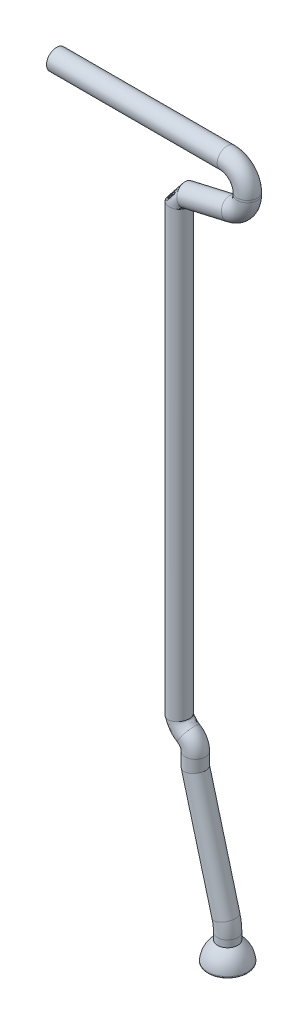
ISO-10303-21;
HEADER;
FILE_DESCRIPTION(('STEP AP214'),'2;1');
FILE_NAME('part.step','',(''),(''),'','','');
FILE_SCHEMA(('AUTOMOTIVE_DESIGN { 1 0 10303 214 1 1 1 1 }'));
ENDSEC;
DATA;
#1=APPLICATION_CONTEXT('core data for automotive mechanical design processes');
#2=APPLICATION_PROTOCOL_DEFINITION('international standard','automotive_design',2000,#1);
#3=PRODUCT_CONTEXT('',#1,'mechanical');
#4=PRODUCT('Part','Part','',(#3));
#5=PRODUCT_RELATED_PRODUCT_CATEGORY('part','',(#4));
#6=PRODUCT_DEFINITION_FORMATION('','',#4);
#7=PRODUCT_DEFINITION_CONTEXT('part definition',#1,'design');
#8=PRODUCT_DEFINITION('design','',#6,#7);
#9=PRODUCT_DEFINITION_SHAPE('','',#8);
#10=(LENGTH_UNIT() NAMED_UNIT(*) SI_UNIT(.MILLI.,.METRE.));
#11=(NAMED_UNIT(*) PLANE_ANGLE_UNIT() SI_UNIT($,.RADIAN.));
#12=(NAMED_UNIT(*) SI_UNIT($,.STERADIAN.) SOLID_ANGLE_UNIT());
#13=UNCERTAINTY_MEASURE_WITH_UNIT(LENGTH_MEASURE(1.E-05),#10,'distance_accuracy_value','');
#14=(GEOMETRIC_REPRESENTATION_CONTEXT(3) GLOBAL_UNCERTAINTY_ASSIGNED_CONTEXT((#13)) GLOBAL_UNIT_ASSIGNED_CONTEXT((#10,
#11,#12)) REPRESENTATION_CONTEXT('',''));
#15=CARTESIAN_POINT('',(0.,0.,0.));
#16=DIRECTION('',(0.,0.,1.));
#17=DIRECTION('',(1.,0.,0.));
#18=AXIS2_PLACEMENT_3D('',#15,#16,#17);
#19=CARTESIAN_POINT('',(14.5384757729335,-40.5165249758739,0.));
#20=DIRECTION('',(0.,-1.,0.));
#21=DIRECTION('',(0.,0.,-1.));
#22=AXIS2_PLACEMENT_3D('',#19,#20,#21);
#23=CYLINDRICAL_SURFACE('',#22,2.49999999999999);
#24=CARTESIAN_POINT('',(14.5384757729335,-40.5165249758739,0.));
#25=DIRECTION('',(0.,-1.,0.));
#26=DIRECTION('',(1.,0.,0.));
#27=AXIS2_PLACEMENT_3D('',#24,#25,#26);
#28=CIRCLE('',#27,2.49999999999999);
#29=CARTESIAN_POINT('',(17.0384757729335,-40.5165249758739,0.));
#30=VERTEX_POINT('',#29);
#31=EDGE_CURVE('E48',#30,#30,#28,.T.);
#32=ORIENTED_EDGE('',*,*,#31,.T.);
#33=EDGE_LOOP('',(#32));
#34=FACE_BOUND('',#33,.T.);
#35=CARTESIAN_POINT('',(14.5384757729335,-42.2,0.));
#36=DIRECTION('',(0.,-1.,0.));
#37=DIRECTION('',(1.,0.,0.));
#38=AXIS2_PLACEMENT_3D('',#35,#36,#37);
#39=CIRCLE('',#38,2.49999999999999);
#40=CARTESIAN_POINT('',(17.0384757729335,-42.2,0.));
#41=VERTEX_POINT('',#40);
#42=EDGE_CURVE('E13',#41,#41,#39,.T.);
#43=ORIENTED_EDGE('',*,*,#42,.F.);
#44=EDGE_LOOP('',(#43));
#45=FACE_BOUND('',#44,.T.);
#46=ADVANCED_FACE('F42',(#34,#45),#23,.T.);
#47=CARTESIAN_POINT('',(2.03847577293351,-40.5165249758739,0.));
#48=DIRECTION('',(0.,0.,-1.));
#49=DIRECTION('',(-1.,0.,0.));
#50=AXIS2_PLACEMENT_3D('',#47,#48,#49);
#51=TOROIDAL_SURFACE('',#50,12.5,2.49999999999999);
#52=CARTESIAN_POINT('',(14.1125486015469,-37.2812869120925,0.));
#53=DIRECTION('',(0.258819045102514,-0.96592582628907,0.));
#54=DIRECTION('',(0.96592582628907,0.258819045102514,0.));
#55=AXIS2_PLACEMENT_3D('',#52,#53,#54);
#56=CIRCLE('',#55,2.49999999999999);
#57=CARTESIAN_POINT('',(16.5273631672695,-36.6342392993362,0.));
#58=VERTEX_POINT('',#57);
#59=EDGE_CURVE('E75',#58,#58,#56,.T.);
#60=CARTESIAN_POINT('',(2.03847577293351,-40.5165249758739,0.));
#61=DIRECTION('',(0.,0.,-1.));
#62=DIRECTION('',(-1.,0.,0.));
#63=AXIS2_PLACEMENT_3D('',#60,#61,#62);
#64=CIRCLE('',#63,15.);
#65=EDGE_CURVE('',#58,#30,#64,.T.);
#66=ORIENTED_EDGE('',*,*,#59,.T.);
#67=ORIENTED_EDGE('',*,*,#31,.F.);
#68=ORIENTED_EDGE('',*,*,#65,.T.);
#69=ORIENTED_EDGE('',*,*,#65,.F.);
#70=EDGE_LOOP('',(#66,#68,#67,#69));
#71=FACE_BOUND('',#70,.T.);
#72=ADVANCED_FACE('F82',(#71),#51,.T.);
#73=CARTESIAN_POINT('',(6.50000000000001,-8.87086875603153,0.));
#74=DIRECTION('',(0.258819045102515,-0.96592582628907,0.));
#75=DIRECTION('',(0.96592582628907,0.258819045102515,0.));
#76=AXIS2_PLACEMENT_3D('',#73,#74,#75);
#77=CYLINDRICAL_SURFACE('',#76,2.49999999999999);
#78=CARTESIAN_POINT('',(6.50000000000001,-8.87086875603153,0.));
#79=DIRECTION('',(0.130526192220048,-0.991444861373811,0.));
#80=DIRECTION('',(-0.991444861373811,-0.130526192220048,0.));
#81=AXIS2_PLACEMENT_3D('',#78,#79,#80);
#82=ELLIPSE('',#81,2.52157240145037,2.49999999999999);
#83=CARTESIAN_POINT('',(4.00000000000002,-9.20000000000001,0.));
#84=VERTEX_POINT('',#83);
#85=EDGE_CURVE('E72',#84,#84,#82,.F.);
#86=ORIENTED_EDGE('',*,*,#85,.F.);
#87=EDGE_LOOP('',(#86));
#88=FACE_BOUND('',#87,.T.);
#89=ORIENTED_EDGE('',*,*,#59,.F.);
#90=EDGE_LOOP('',(#89));
#91=FACE_BOUND('',#90,.T.);
#92=ADVANCED_FACE('F84',(#88,#91),#77,.T.);
#93=CARTESIAN_POINT('',(6.50000000000001,-5.58007283046414,0.));
#94=DIRECTION('',(0.,-1.,0.));
#95=DIRECTION('',(0.,0.,-1.));
#96=AXIS2_PLACEMENT_3D('',#93,#94,#95);
#97=CYLINDRICAL_SURFACE('',#96,2.49999999999999);
#98=CARTESIAN_POINT('',(6.50000000000001,-5.58007283046414,0.));
#99=DIRECTION('',(0.,-1.,0.));
#100=DIRECTION('',(1.,0.,0.));
#101=AXIS2_PLACEMENT_3D('',#98,#99,#100);
#102=CIRCLE('',#101,2.49999999999999);
#103=CARTESIAN_POINT('',(9.,-5.58007283046413,0.));
#104=VERTEX_POINT('',#103);
#105=EDGE_CURVE('E58',#104,#104,#102,.T.);
#106=ORIENTED_EDGE('',*,*,#105,.T.);
#107=EDGE_LOOP('',(#106));
#108=FACE_BOUND('',#107,.T.);
#109=ORIENTED_EDGE('',*,*,#85,.T.);
#110=EDGE_LOOP('',(#109));
#111=FACE_BOUND('',#110,.T.);
#112=ADVANCED_FACE('F90',(#108,#111),#97,.T.);
#113=CARTESIAN_POINT('',(3.00000000000003,-5.58007283046414,0.));
#114=DIRECTION('',(0.,0.,-1.));
#115=DIRECTION('',(-1.,0.,0.));
#116=AXIS2_PLACEMENT_3D('',#113,#114,#115);
#117=TOROIDAL_SURFACE('',#116,3.49999999999998,2.49999999999999);
#118=CARTESIAN_POINT('',(4.83745806223148,-2.60118916883173,0.));
#119=DIRECTION('',(0.851109617609264,-0.524988017780419,0.));
#120=DIRECTION('',(0.524988017780419,0.851109617609264,0.));
#121=AXIS2_PLACEMENT_3D('',#118,#119,#120);
#122=CIRCLE('',#121,2.49999999999999);
#123=CARTESIAN_POINT('',(6.14992810668252,-0.473415124808582,0.));
#124=VERTEX_POINT('',#123);
#125=EDGE_CURVE('E166',#124,#124,#122,.T.);
#126=CARTESIAN_POINT('',(3.00000000000003,-5.58007283046414,0.));
#127=DIRECTION('',(0.,0.,-1.));
#128=DIRECTION('',(-1.,0.,0.));
#129=AXIS2_PLACEMENT_3D('',#126,#127,#128);
#130=CIRCLE('',#129,5.99999999999997);
#131=EDGE_CURVE('',#124,#104,#130,.T.);
#132=ORIENTED_EDGE('',*,*,#125,.T.);
#133=ORIENTED_EDGE('',*,*,#105,.F.);
#134=ORIENTED_EDGE('',*,*,#131,.T.);
#135=ORIENTED_EDGE('',*,*,#131,.F.);
#136=EDGE_LOOP('',(#132,#134,#133,#135));
#137=FACE_BOUND('',#136,.T.);
#138=ADVANCED_FACE('F96',(#137),#117,.T.);
#139=CARTESIAN_POINT('',(2.49999999999997,111.017615984978,0.));
#140=DIRECTION('',(0.,-1.,0.));
#141=DIRECTION('',(0.,0.,-1.));
#142=AXIS2_PLACEMENT_3D('',#139,#140,#141);
#143=CYLINDRICAL_SURFACE('',#142,2.49999999999999);
#144=CARTESIAN_POINT('',(2.49999999999997,111.017615984978,0.));
#145=DIRECTION('',(0.,-1.,0.));
#146=DIRECTION('',(0.,0.,-1.));
#147=AXIS2_PLACEMENT_3D('',#144,#145,#146);
#148=CIRCLE('',#147,2.49999999999999);
#149=CARTESIAN_POINT('',(4.99999999999998,111.017615984978,0.));
#150=VERTEX_POINT('',#149);
#151=EDGE_CURVE('E52',#150,#150,#148,.T.);
#152=ORIENTED_EDGE('',*,*,#151,.T.);
#153=EDGE_LOOP('',(#152));
#154=FACE_BOUND('',#153,.T.);
#155=CARTESIAN_POINT('',(4.99999999999997,0.661344353542473,0.));
#156=CARTESIAN_POINT('',(4.99999999999996,0.661344353542473,-4.99999999999998));
#157=CARTESIAN_POINT('',(0.,0.,-4.99999999999998));
#158=CARTESIAN_POINT('',(0.,0.,0.));
#159=CARTESIAN_POINT('',(0.,0.,4.99999999999998));
#160=CARTESIAN_POINT('',(4.99999999999997,0.661344353542473,4.99999999999998));
#161=CARTESIAN_POINT('',(4.99999999999997,0.661344353542473,0.));
#162=(BOUNDED_CURVE() B_SPLINE_CURVE(3,(#155,#156,#157,#158,#159,#160,#161),.UNSPECIFIED.,.T.,
.F.) B_SPLINE_CURVE_WITH_KNOTS((4,3,4),(0.,0.5,1.),
.UNSPECIFIED.) CURVE() GEOMETRIC_REPRESENTATION_ITEM() RATIONAL_B_SPLINE_CURVE((1.,
0.333333333333333,0.333333333333333,1.,0.333333333333333,0.333333333333333,1.)) REPRESENTATION_ITEM(''));
#163=CARTESIAN_POINT('',(4.99999999999997,0.661344353542473,0.));
#164=VERTEX_POINT('',#163);
#165=EDGE_CURVE('E159',#164,#164,#162,.T.);
#166=ORIENTED_EDGE('',*,*,#165,.T.);
#167=EDGE_LOOP('',(#166));
#168=FACE_BOUND('',#167,.T.);
#169=ADVANCED_FACE('F54',(#154,#168),#143,.T.);
#170=CARTESIAN_POINT('',(5.,111.017615984978,0.));
#171=DIRECTION('',(0.,0.,1.));
#172=DIRECTION('',(1.,0.,0.));
#173=AXIS2_PLACEMENT_3D('',#170,#171,#172);
#174=TOROIDAL_SURFACE('',#173,2.50000000000003,2.49999999999999);
#175=CARTESIAN_POINT('',(4.44072713472685,113.454255856229,0.));
#176=DIRECTION('',(-0.974655948500326,-0.223709146109252,0.));
#177=DIRECTION('',(0.,0.,-1.));
#178=AXIS2_PLACEMENT_3D('',#175,#176,#177);
#179=CIRCLE('',#178,2.49999999999999);
#180=EDGE_CURVE('E59',#150,#150,#179,.T.);
#181=ORIENTED_EDGE('',*,*,#180,.T.);
#182=ORIENTED_EDGE('',*,*,#151,.F.);
#183=EDGE_LOOP('',(#181,#182));
#184=FACE_BOUND('',#183,.T.);
#185=ADVANCED_FACE('F61',(#184),#174,.T.);
#186=CARTESIAN_POINT('',(15.5518427046747,116.004548788108,0.));
#187=DIRECTION('',(-0.974655948500325,-0.223709146109252,0.));
#188=DIRECTION('',(0.223709146109252,-0.974655948500326,0.));
#189=AXIS2_PLACEMENT_3D('',#186,#187,#188);
#190=CYLINDRICAL_SURFACE('',#189,2.49999999999999);
#191=CARTESIAN_POINT('',(15.5518427046747,116.004548788108,0.));
#192=DIRECTION('',(-0.974655948500326,-0.223709146109252,0.));
#193=DIRECTION('',(0.,0.,-1.));
#194=AXIS2_PLACEMENT_3D('',#191,#192,#193);
#195=CIRCLE('',#194,2.49999999999999);
#196=CARTESIAN_POINT('',(16.1111155699479,113.567908916857,0.));
#197=VERTEX_POINT('',#196);
#198=EDGE_CURVE('E63',#197,#197,#195,.T.);
#199=ORIENTED_EDGE('',*,*,#198,.T.);
#200=EDGE_LOOP('',(#199));
#201=FACE_BOUND('',#200,.T.);
#202=ORIENTED_EDGE('',*,*,#180,.F.);
#203=EDGE_LOOP('',(#202));
#204=FACE_BOUND('',#203,.T.);
#205=ADVANCED_FACE('F105',(#201,#204),#190,.T.);
#206=CARTESIAN_POINT('',(14.4332969741285,120.87782853061,0.));
#207=DIRECTION('',(0.,0.,-1.));
#208=DIRECTION('',(-1.,0.,0.));
#209=AXIS2_PLACEMENT_3D('',#206,#207,#208);
#210=TOROIDAL_SURFACE('',#209,4.99999999999998,2.49999999999999);
#211=CARTESIAN_POINT('',(19.4332969741285,120.87782853061,0.));
#212=DIRECTION('',(0.,-1.,0.));
#213=DIRECTION('',(0.,0.,-1.));
#214=AXIS2_PLACEMENT_3D('',#211,#212,#213);
#215=CIRCLE('',#214,2.49999999999999);
#216=CARTESIAN_POINT('',(21.9332969741285,120.87782853061,0.));
#217=VERTEX_POINT('',#216);
#218=EDGE_CURVE('E66',#217,#217,#215,.T.);
#219=CARTESIAN_POINT('',(14.4332969741285,120.87782853061,0.));
#220=DIRECTION('',(0.,0.,-1.));
#221=DIRECTION('',(-1.,0.,0.));
#222=AXIS2_PLACEMENT_3D('',#219,#220,#221);
#223=CIRCLE('',#222,7.49999999999997);
#224=EDGE_CURVE('',#217,#197,#223,.T.);
#225=ORIENTED_EDGE('',*,*,#218,.T.);
#226=ORIENTED_EDGE('',*,*,#198,.F.);
#227=ORIENTED_EDGE('',*,*,#224,.T.);
#228=ORIENTED_EDGE('',*,*,#224,.F.);
#229=EDGE_LOOP('',(#225,#227,#226,#228));
#230=FACE_BOUND('',#229,.T.);
#231=ADVANCED_FACE('F108',(#230),#210,.T.);
#232=CARTESIAN_POINT('',(19.4332969741285,121.386636523099,0.));
#233=DIRECTION('',(0.,-1.,0.));
#234=DIRECTION('',(0.,0.,-1.));
#235=AXIS2_PLACEMENT_3D('',#232,#233,#234);
#236=CYLINDRICAL_SURFACE('',#235,2.49999999999999);
#237=CARTESIAN_POINT('',(19.4332969741285,121.386636523099,0.));
#238=DIRECTION('',(0.,-1.,0.));
#239=DIRECTION('',(0.,0.,-1.));
#240=AXIS2_PLACEMENT_3D('',#237,#238,#239);
#241=CIRCLE('',#240,2.49999999999999);
#242=CARTESIAN_POINT('',(21.9332969741285,121.386636523099,0.));
#243=VERTEX_POINT('',#242);
#244=EDGE_CURVE('E176',#243,#243,#241,.T.);
#245=ORIENTED_EDGE('',*,*,#244,.T.);
#246=EDGE_LOOP('',(#245));
#247=FACE_BOUND('',#246,.T.);
#248=ORIENTED_EDGE('',*,*,#218,.F.);
#249=EDGE_LOOP('',(#248));
#250=FACE_BOUND('',#249,.T.);
#251=ADVANCED_FACE('F112',(#247,#250),#236,.T.);
#252=CARTESIAN_POINT('',(14.4332969741285,121.386636523099,0.));
#253=DIRECTION('',(0.,0.,-1.));
#254=DIRECTION('',(-1.,0.,0.));
#255=AXIS2_PLACEMENT_3D('',#252,#253,#254);
#256=TOROIDAL_SURFACE('',#255,4.99999999999999,2.49999999999999);
#257=CARTESIAN_POINT('',(14.4332969741285,126.386636523099,0.));
#258=DIRECTION('',(1.,0.,0.));
#259=DIRECTION('',(0.,0.,-1.));
#260=AXIS2_PLACEMENT_3D('',#257,#258,#259);
#261=CIRCLE('',#260,2.49999999999999);
#262=CARTESIAN_POINT('',(14.4332969741285,128.886636523099,0.));
#263=VERTEX_POINT('',#262);
#264=EDGE_CURVE('E173',#263,#263,#261,.T.);
#265=CARTESIAN_POINT('',(14.4332969741285,121.386636523099,0.));
#266=DIRECTION('',(0.,0.,-1.));
#267=DIRECTION('',(-1.,0.,0.));
#268=AXIS2_PLACEMENT_3D('',#265,#266,#267);
#269=CIRCLE('',#268,7.49999999999998);
#270=EDGE_CURVE('',#263,#243,#269,.T.);
#271=ORIENTED_EDGE('',*,*,#264,.T.);
#272=ORIENTED_EDGE('',*,*,#244,.F.);
#273=ORIENTED_EDGE('',*,*,#270,.T.);
#274=ORIENTED_EDGE('',*,*,#270,.F.);
#275=EDGE_LOOP('',(#271,#273,#272,#274));
#276=FACE_BOUND('',#275,.T.);
#277=ADVANCED_FACE('F116',(#276),#256,.T.);
#278=CARTESIAN_POINT('',(14.4332969741285,126.386636523099,0.));
#279=DIRECTION('',(-1.,0.,0.));
#280=DIRECTION('',(0.,0.,1.));
#281=AXIS2_PLACEMENT_3D('',#278,#279,#280);
#282=CYLINDRICAL_SURFACE('',#281,2.49999999999999);
#283=ORIENTED_EDGE('',*,*,#264,.F.);
#284=EDGE_LOOP('',(#283));
#285=FACE_BOUND('',#284,.T.);
#286=CARTESIAN_POINT('',(-28.0667030258715,126.386636523099,0.));
#287=DIRECTION('',(1.,0.,0.));
#288=DIRECTION('',(0.,0.,-1.));
#289=AXIS2_PLACEMENT_3D('',#286,#287,#288);
#290=CIRCLE('',#289,2.49999999999999);
#291=CARTESIAN_POINT('',(-28.0667030258715,126.386636523099,-2.49999999999999));
#292=VERTEX_POINT('',#291);
#293=EDGE_CURVE('E172',#292,#292,#290,.T.);
#294=ORIENTED_EDGE('',*,*,#293,.T.);
#295=EDGE_LOOP('',(#294));
#296=FACE_BOUND('',#295,.T.);
#297=ADVANCED_FACE('F120',(#285,#296),#282,.T.);
#298=CARTESIAN_POINT('',(-28.0667030258715,126.386636523099,0.));
#299=DIRECTION('',(1.,0.,0.));
#300=DIRECTION('',(0.,0.,-1.));
#301=AXIS2_PLACEMENT_3D('',#298,#299,#300);
#302=PLANE('',#301);
#303=ORIENTED_EDGE('',*,*,#293,.F.);
#304=EDGE_LOOP('',(#303));
#305=FACE_BOUND('',#304,.T.);
#306=ADVANCED_FACE('F124',(#305),#302,.F.);
#307=CARTESIAN_POINT('',(4.99999999999997,0.661344353542473,0.));
#308=CARTESIAN_POINT('',(5.09342875409255,0.31434580245455,0.));
#309=CARTESIAN_POINT('',(5.27775533986298,0.358120059973208,0.));
#310=CARTESIAN_POINT('',(5.55771369306094,-0.0633598801821715,0.));
#311=CARTESIAN_POINT('',(5.94206200015745,-0.327915632549423,0.));
#312=CARTESIAN_POINT('',(5.9171602671454,-0.32983746553494,0.));
#313=CARTESIAN_POINT('',(6.14992810668252,-0.473415124808583,0.));
#314=CARTESIAN_POINT('',(4.99999999999996,0.661344353542473,-4.99999999999998));
#315=CARTESIAN_POINT('',(5.24880282737219,-0.262720421196903,-4.99999999999998));
#316=CARTESIAN_POINT('',(5.22686957816135,0.617469563909078,-4.99999999999998));
#317=CARTESIAN_POINT('',(5.50022233848552,-0.0739907628382071,-4.99999999999998));
#318=CARTESIAN_POINT('',(6.1369984757209,-0.436830606906832,-4.99999999999998));
#319=CARTESIAN_POINT('',(5.49727002850553,-0.0708375206299673,-4.99999999999998));
#320=CARTESIAN_POINT('',(6.14992810668252,-0.473415124808585,-4.99999999999998));
#321=CARTESIAN_POINT('',(0.,0.,-4.99999999999998));
#322=CARTESIAN_POINT('',(0.248802827372209,-0.924064774739385,-4.99999999999998));
#323=CARTESIAN_POINT('',(0.520019898361593,-1.4205895785544,-4.99999999999998));
#324=CARTESIAN_POINT('',(1.37272026997733,-2.92040010740489,-4.99999999999998));
#325=CARTESIAN_POINT('',(2.56291743473023,-4.03889350068667,-4.99999999999998));
#326=CARTESIAN_POINT('',(2.87232993960345,-4.32638560867627,-4.99999999999998));
#327=CARTESIAN_POINT('',(3.52498801778044,-4.72896321285488,-4.99999999999998));
#328=CARTESIAN_POINT('',(0.,0.,0.));
#329=CARTESIAN_POINT('',(0.171115790732387,-0.635531662913659,0.));
#330=CARTESIAN_POINT('',(0.545462779212408,-1.55026433052234,0.));
#331=CARTESIAN_POINT('',(1.40146594726504,-2.91508466607688,0.));
#332=CARTESIAN_POINT('',(2.4654491969485,-3.98443601350796,0.));
#333=CARTESIAN_POINT('',(3.08227505892339,-4.45588558112875,0.));
#334=CARTESIAN_POINT('',(3.52498801778044,-4.72896321285488,0.));
#335=CARTESIAN_POINT('',(0.,0.,4.99999999999998));
#336=CARTESIAN_POINT('',(0.0934287540925652,-0.346998551087933,4.99999999999998));
#337=CARTESIAN_POINT('',(0.570905660063223,-1.67993908249027,4.99999999999998));
#338=CARTESIAN_POINT('',(1.43021162455275,-2.90976922474886,4.99999999999998));
#339=CARTESIAN_POINT('',(2.36798095916678,-3.92997852632926,4.99999999999998));
#340=CARTESIAN_POINT('',(3.29222017824332,-4.58538555358124,4.99999999999998));
#341=CARTESIAN_POINT('',(3.52498801778044,-4.72896321285488,4.99999999999998));
#342=CARTESIAN_POINT('',(4.99999999999997,0.661344353542473,4.99999999999998));
#343=CARTESIAN_POINT('',(4.9380546808129,0.891412026106003,4.99999999999998));
#344=CARTESIAN_POINT('',(5.32864110156461,0.098770556037336,4.99999999999998));
#345=CARTESIAN_POINT('',(5.61520504763635,-0.0527289975261354,4.99999999999998));
#346=CARTESIAN_POINT('',(5.747125524594,-0.219000658192014,4.99999999999998));
#347=CARTESIAN_POINT('',(6.33705050578528,-0.588837410439915,4.99999999999998));
#348=CARTESIAN_POINT('',(6.14992810668253,-0.473415124808583,4.99999999999998));
#349=CARTESIAN_POINT('',(4.99999999999997,0.661344353542473,0.));
#350=CARTESIAN_POINT('',(5.09342875409255,0.31434580245455,0.));
#351=CARTESIAN_POINT('',(5.27775533986298,0.358120059973208,0.));
#352=CARTESIAN_POINT('',(5.55771369306094,-0.0633598801821715,0.));
#353=CARTESIAN_POINT('',(5.94206200015745,-0.327915632549423,0.));
#354=CARTESIAN_POINT('',(5.9171602671454,-0.32983746553494,0.));
#355=CARTESIAN_POINT('',(6.14992810668252,-0.473415124808583,0.));
#356=(BOUNDED_SURFACE() B_SPLINE_SURFACE(3,3,((#307,#308,#309,#310,#311,#312,#313),(#314,#315,
#316,#317,#318,#319,#320),(#321,#322,#323,#324,#325,#326,#327),(#328,#329,#330,#331,#332,#333,
#334),(#335,#336,#337,#338,#339,#340,#341),(#342,#343,#344,#345,#346,#347,#348),(#349,#350,#351,
#352,#353,#354,#355)),.UNSPECIFIED.,.T.,.F.,.F.) B_SPLINE_SURFACE_WITH_KNOTS((4,3,4),(4,1,1,1,
4),(0.,0.5,1.),(0.,0.282354404311687,0.56745608018004,0.786680189524266,1.),
.UNSPECIFIED.) GEOMETRIC_REPRESENTATION_ITEM() RATIONAL_B_SPLINE_SURFACE(((1.,1.,1.,1.,1.,1.,
1.),(0.333333333333333,0.333333333333333,0.333333333333333,0.333333333333333,0.333333333333333,
0.333333333333333,0.333333333333333),(0.333333333333333,0.333333333333333,0.333333333333333,
0.333333333333333,0.333333333333333,0.333333333333333,0.333333333333333),(1.,1.,1.,1.,1.,1.,1.),
(0.333333333333333,0.333333333333333,0.333333333333333,0.333333333333333,0.333333333333333,
0.333333333333333,0.333333333333333),(0.333333333333333,0.333333333333333,0.333333333333333,
0.333333333333333,0.333333333333333,0.333333333333333,0.333333333333333),(1.,1.,1.,1.,1.,1.,1.))) REPRESENTATION_ITEM('') SURFACE());
#357=ORIENTED_EDGE('',*,*,#165,.F.);
#358=EDGE_LOOP('',(#357));
#359=FACE_BOUND('',#358,.T.);
#360=ORIENTED_EDGE('',*,*,#125,.F.);
#361=EDGE_LOOP('',(#360));
#362=FACE_BOUND('',#361,.T.);
#363=ADVANCED_FACE('F128',(#359,#362),#356,.F.);
#364=CARTESIAN_POINT('',(14.5384757729335,-47.2,0.));
#365=DIRECTION('',(0.,1.,0.));
#366=DIRECTION('',(0.,0.,1.));
#367=AXIS2_PLACEMENT_3D('',#364,#365,#366);
#368=DEGENERATE_TOROIDAL_SURFACE('',#367,1.2500000000001,6.25000000000001,.F.);
#369=CARTESIAN_POINT('',(14.5384757729335,-46.6565217391305,0.));
#370=DIRECTION('',(0.,1.,0.));
#371=DIRECTION('',(0.,0.,1.));
#372=AXIS2_PLACEMENT_3D('',#369,#370,#371);
#373=CIRCLE('',#372,4.97632567249426);
#374=CARTESIAN_POINT('',(14.5384757729335,-46.6565217391305,4.97632567249426));
#375=VERTEX_POINT('',#374);
#376=EDGE_CURVE('E156',#375,#375,#373,.T.);
#377=ORIENTED_EDGE('',*,*,#376,.T.);
#378=EDGE_LOOP('',(#377));
#379=FACE_BOUND('',#378,.T.);
#380=ORIENTED_EDGE('',*,*,#42,.T.);
#381=EDGE_LOOP('',(#380));
#382=FACE_BOUND('',#381,.T.);
#383=ADVANCED_FACE('F134',(#379,#382),#368,.F.);
#384=CARTESIAN_POINT('',(14.5384757729335,-46.7,0.));
#385=DIRECTION('',(0.,1.,0.));
#386=DIRECTION('',(0.,0.,1.));
#387=AXIS2_PLACEMENT_3D('',#384,#385,#386);
#388=TOROIDAL_SURFACE('',#387,4.47821961869471,0.5);
#389=CARTESIAN_POINT('',(14.5384757729335,-47.2,0.));
#390=DIRECTION('',(0.,1.,0.));
#391=DIRECTION('',(0.,0.,1.));
#392=AXIS2_PLACEMENT_3D('',#389,#390,#391);
#393=CIRCLE('',#392,4.47821961869471);
#394=CARTESIAN_POINT('',(14.5384757729335,-47.2,4.47821961869471));
#395=VERTEX_POINT('',#394);
#396=EDGE_CURVE('E155',#395,#395,#393,.T.);
#397=ORIENTED_EDGE('',*,*,#396,.T.);
#398=EDGE_LOOP('',(#397));
#399=FACE_BOUND('',#398,.T.);
#400=ORIENTED_EDGE('',*,*,#376,.F.);
#401=EDGE_LOOP('',(#400));
#402=FACE_BOUND('',#401,.T.);
#403=ADVANCED_FACE('F143',(#399,#402),#388,.T.);
#404=CARTESIAN_POINT('',(14.5384757729335,-47.2,0.));
#405=DIRECTION('',(0.,-1.,0.));
#406=DIRECTION('',(0.,0.,-1.));
#407=AXIS2_PLACEMENT_3D('',#404,#405,#406);
#408=PLANE('',#407);
#409=ORIENTED_EDGE('',*,*,#396,.F.);
#410=EDGE_LOOP('',(#409));
#411=FACE_BOUND('',#410,.T.);
#412=ADVANCED_FACE('F147',(#411),#408,.T.);
#413=CLOSED_SHELL('',(#46,#72,#92,#112,#138,#169,#185,#205,#231,#251,#277,#297,#306,#363,#383,
#403,#412));
#414=MANIFOLD_SOLID_BREP('B2',#413);
#415=ADVANCED_BREP_SHAPE_REPRESENTATION('',(#18,#414),#14);
#416=SHAPE_DEFINITION_REPRESENTATION(#9,#415);
ENDSEC;
END-ISO-10303-21;
